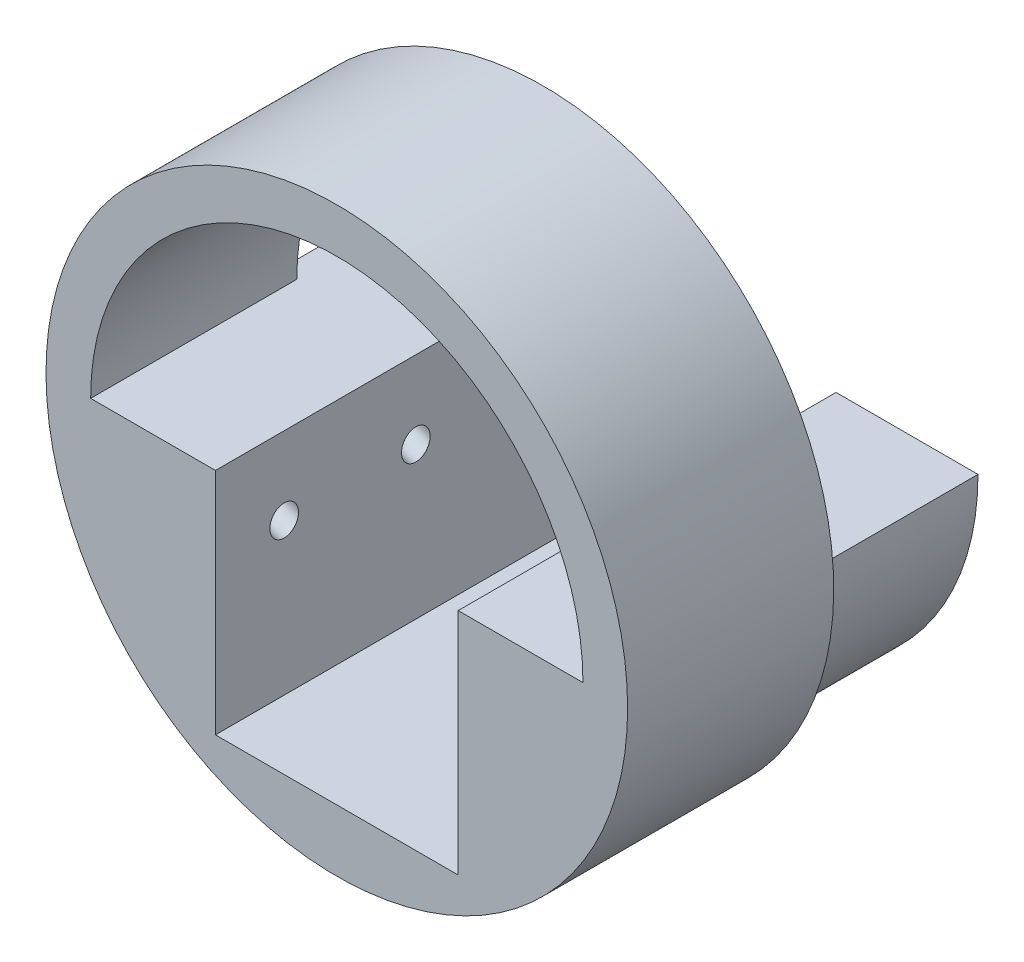
ISO-10303-21;
HEADER;
FILE_DESCRIPTION(('STEP AP214'),'2;1');
FILE_NAME('part.step','',(''),(''),'','','');
FILE_SCHEMA(('AUTOMOTIVE_DESIGN { 1 0 10303 214 1 1 1 1 }'));
ENDSEC;
DATA;
#1=APPLICATION_CONTEXT('core data for automotive mechanical design processes');
#2=APPLICATION_PROTOCOL_DEFINITION('international standard','automotive_design',2000,#1);
#3=PRODUCT_CONTEXT('',#1,'mechanical');
#4=PRODUCT('Part','Part','',(#3));
#5=PRODUCT_RELATED_PRODUCT_CATEGORY('part','',(#4));
#6=PRODUCT_DEFINITION_FORMATION('','',#4);
#7=PRODUCT_DEFINITION_CONTEXT('part definition',#1,'design');
#8=PRODUCT_DEFINITION('design','',#6,#7);
#9=PRODUCT_DEFINITION_SHAPE('','',#8);
#10=(LENGTH_UNIT() NAMED_UNIT(*) SI_UNIT(.MILLI.,.METRE.));
#11=(NAMED_UNIT(*) PLANE_ANGLE_UNIT() SI_UNIT($,.RADIAN.));
#12=(NAMED_UNIT(*) SI_UNIT($,.STERADIAN.) SOLID_ANGLE_UNIT());
#13=UNCERTAINTY_MEASURE_WITH_UNIT(LENGTH_MEASURE(1.E-05),#10,'distance_accuracy_value','');
#14=(GEOMETRIC_REPRESENTATION_CONTEXT(3) GLOBAL_UNCERTAINTY_ASSIGNED_CONTEXT((#13)) GLOBAL_UNIT_ASSIGNED_CONTEXT((#10,
#11,#12)) REPRESENTATION_CONTEXT('',''));
#15=CARTESIAN_POINT('',(0.,0.,0.));
#16=DIRECTION('',(0.,0.,1.));
#17=DIRECTION('',(1.,0.,0.));
#18=AXIS2_PLACEMENT_3D('',#15,#16,#17);
#19=CARTESIAN_POINT('',(0.,0.,0.));
#20=DIRECTION('',(0.,0.,1.));
#21=DIRECTION('',(1.,0.,0.));
#22=AXIS2_PLACEMENT_3D('',#19,#20,#21);
#23=CYLINDRICAL_SURFACE('',#22,21.5);
#24=CARTESIAN_POINT('',(0.,0.,15.));
#25=DIRECTION('',(0.,0.,-1.));
#26=DIRECTION('',(-1.,0.,0.));
#27=AXIS2_PLACEMENT_3D('',#24,#25,#26);
#28=CIRCLE('',#27,21.5);
#29=CARTESIAN_POINT('',(21.5,0.,15.));
#30=VERTEX_POINT('',#29);
#31=CARTESIAN_POINT('',(-21.5,0.,15.));
#32=VERTEX_POINT('',#31);
#33=EDGE_CURVE('E118',#30,#32,#28,.F.);
#34=ORIENTED_EDGE('',*,*,#33,.F.);
#35=DIRECTION('',(0.,0.,1.));
#36=VECTOR('',#35,1.);
#37=CARTESIAN_POINT('',(21.5,0.,0.));
#38=LINE('',#37,#36);
#39=CARTESIAN_POINT('',(21.5,0.,33.));
#40=VERTEX_POINT('',#39);
#41=EDGE_CURVE('E151',#30,#40,#38,.T.);
#42=ORIENTED_EDGE('',*,*,#41,.T.);
#43=CARTESIAN_POINT('',(0.,0.,33.));
#44=DIRECTION('',(0.,0.,1.));
#45=DIRECTION('',(1.,0.,0.));
#46=AXIS2_PLACEMENT_3D('',#43,#44,#45);
#47=CIRCLE('',#46,21.5);
#48=CARTESIAN_POINT('',(-21.5,0.,33.));
#49=VERTEX_POINT('',#48);
#50=EDGE_CURVE('E136',#40,#49,#47,.T.);
#51=ORIENTED_EDGE('',*,*,#50,.T.);
#52=DIRECTION('',(0.,0.,1.));
#53=VECTOR('',#52,1.);
#54=CARTESIAN_POINT('',(-21.5,0.,0.));
#55=LINE('',#54,#53);
#56=EDGE_CURVE('E130',#32,#49,#55,.T.);
#57=ORIENTED_EDGE('',*,*,#56,.F.);
#58=EDGE_LOOP('',(#34,#42,#51,#57));
#59=FACE_BOUND('',#58,.T.);
#60=ADVANCED_FACE('F41',(#59),#23,.F.);
#61=CARTESIAN_POINT('',(0.,0.,33.));
#62=DIRECTION('',(0.,0.,-1.));
#63=DIRECTION('',(-1.,0.,0.));
#64=AXIS2_PLACEMENT_3D('',#61,#62,#63);
#65=CYLINDRICAL_SURFACE('',#64,25.4);
#66=CARTESIAN_POINT('',(-25.2470984850926,-2.78280759019296,27.));
#67=CARTESIAN_POINT('',(-25.2470992023778,-2.7828033142921,26.9349369943768));
#68=CARTESIAN_POINT('',(-25.2477245907166,-2.77714528730477,26.8698188111489));
#69=CARTESIAN_POINT('',(-25.2501755970138,-2.75476909462255,26.7414848548694));
#70=CARTESIAN_POINT('',(-25.2520028646143,-2.73803572724584,26.6782718216295));
#71=CARTESIAN_POINT('',(-25.2567017748821,-2.69434456759552,26.5557435200155));
#72=CARTESIAN_POINT('',(-25.2595704450516,-2.66741586678455,26.4964177195756));
#73=CARTESIAN_POINT('',(-25.2661401121993,-2.60445028150421,26.3829052118677));
#74=CARTESIAN_POINT('',(-25.2698410572259,-2.56841396552598,26.3287181841311));
#75=CARTESIAN_POINT('',(-25.2780144597411,-2.48671268275568,26.2242455124884));
#76=CARTESIAN_POINT('',(-25.2825140765213,-2.44068833712564,26.1742438738129));
#77=CARTESIAN_POINT('',(-25.2918857307816,-2.34157933961969,26.0818655540364));
#78=CARTESIAN_POINT('',(-25.2967579040326,-2.28849210854809,26.0394916717732));
#79=CARTESIAN_POINT('',(-25.3071027588989,-2.1712516492531,25.9592458913499));
#80=CARTESIAN_POINT('',(-25.3125877177234,-2.10652423712848,25.9222141539749));
#81=CARTESIAN_POINT('',(-25.3234148408743,-1.9721084858566,25.8586074957678));
#82=CARTESIAN_POINT('',(-25.3287569441843,-1.90241807203561,25.8320369786799));
#83=CARTESIAN_POINT('',(-25.3394897830852,-1.75391977916117,25.7880045569257));
#84=CARTESIAN_POINT('',(-25.344848451706,-1.67483324354703,25.7714704061136));
#85=CARTESIAN_POINT('',(-25.3549063570621,-1.51497275882659,25.7514530221639));
#86=CARTESIAN_POINT('',(-25.3596054257027,-1.43419838558955,25.7479731100213));
#87=CARTESIAN_POINT('',(-25.3683403335487,-1.2705243975847,25.7543775554942));
#88=CARTESIAN_POINT('',(-25.3723501277205,-1.18763951914522,25.764693271932));
#89=CARTESIAN_POINT('',(-25.3794473989609,-1.02483597468641,25.7994828212928));
#90=CARTESIAN_POINT('',(-25.3825349410196,-0.944917100003764,25.8239556562219));
#91=CARTESIAN_POINT('',(-25.3877352092036,-0.792803551942171,25.8859014455232));
#92=CARTESIAN_POINT('',(-25.389872501333,-0.7204565158814,25.9229967213175));
#93=CARTESIAN_POINT('',(-25.3933868487226,-0.583602450017034,26.0096276728924));
#94=CARTESIAN_POINT('',(-25.3947642102337,-0.519092270157566,26.0591583255083));
#95=CARTESIAN_POINT('',(-25.3968411264572,-0.40440168130521,26.1657779172813));
#96=CARTESIAN_POINT('',(-25.3975795255551,-0.353555239230089,26.2221491540811));
#97=CARTESIAN_POINT('',(-25.3986798667242,-0.262911920894951,26.3431764356503));
#98=CARTESIAN_POINT('',(-25.3990419859301,-0.223109851937651,26.4078285660489));
#99=CARTESIAN_POINT('',(-25.3995239927473,-0.158595788877103,26.5386457527658));
#100=CARTESIAN_POINT('',(-25.3996591099992,-0.133020145091235,26.604385466387));
#101=CARTESIAN_POINT('',(-25.3998341200239,-0.0938886191479115,26.7393482552217));
#102=CARTESIAN_POINT('',(-25.3998740436717,-0.0803288406522046,26.8085701935677));
#103=CARTESIAN_POINT('',(-25.3999148506995,-0.0661243018027638,26.9450101578284));
#104=CARTESIAN_POINT('',(-25.3999174888317,-0.0648998333809021,27.0121684251356));
#105=CARTESIAN_POINT('',(-25.3998928842274,-0.0739024545409846,27.1457070107512));
#106=CARTESIAN_POINT('',(-25.3998656451216,-0.0841281527459091,27.212087422591));
#107=CARTESIAN_POINT('',(-25.3997423358692,-0.115444185880353,27.3413407481168));
#108=CARTESIAN_POINT('',(-25.3996471326358,-0.136396752081029,27.4042471938425));
#109=CARTESIAN_POINT('',(-25.399314924814,-0.188339900254402,27.5257596511105));
#110=CARTESIAN_POINT('',(-25.3990779117555,-0.219331081773828,27.5843654055415));
#111=CARTESIAN_POINT('',(-25.3983575724647,-0.291108559868952,27.6970874530898));
#112=CARTESIAN_POINT('',(-25.3978688311442,-0.332099308743738,27.7510732749127));
#113=CARTESIAN_POINT('',(-25.3965315171046,-0.422150824779794,27.8518140899604));
#114=CARTESIAN_POINT('',(-25.3956828731851,-0.471213187592155,27.89856764991));
#115=CARTESIAN_POINT('',(-25.393467800202,-0.578634604157961,27.9861153348292));
#116=CARTESIAN_POINT('',(-25.3920771141778,-0.637340746997968,28.0264824973185));
#117=CARTESIAN_POINT('',(-25.3886920310633,-0.760330537309656,28.0975151780854));
#118=CARTESIAN_POINT('',(-25.3866974612789,-0.824615776492177,28.1281779160289));
#119=CARTESIAN_POINT('',(-25.3818919115726,-0.961539886204845,28.1811215940134));
#120=CARTESIAN_POINT('',(-25.3790349307647,-1.03444973845587,28.202697491225));
#121=CARTESIAN_POINT('',(-25.3725577495182,-1.1827197224137,28.2341253246166));
#122=CARTESIAN_POINT('',(-25.3689372997548,-1.25808064774726,28.2439734238672));
#123=CARTESIAN_POINT('',(-25.3607274319644,-1.4142102405673,28.2522021491107));
#124=CARTESIAN_POINT('',(-25.3560909830508,-1.49501760423546,28.2498123798495));
#125=CARTESIAN_POINT('',(-25.3461424620279,-1.65514488114434,28.231956418999));
#126=CARTESIAN_POINT('',(-25.3408302045934,-1.73446437949976,28.2164866339183));
#127=CARTESIAN_POINT('',(-25.3295658709198,-1.89196189030294,28.172096382446));
#128=CARTESIAN_POINT('',(-25.3235988223152,-1.97002343147524,28.1427639067084));
#129=CARTESIAN_POINT('',(-25.3114920165989,-2.11991247696271,28.0710358457202));
#130=CARTESIAN_POINT('',(-25.3053522614233,-2.19174005112183,28.0286404068482));
#131=CARTESIAN_POINT('',(-25.293473636138,-2.32476533208917,27.9329091742277));
#132=CARTESIAN_POINT('',(-25.2877283848843,-2.38620104008031,27.8799063006637));
#133=CARTESIAN_POINT('',(-25.2769022539066,-2.49827726961841,27.7633919983072));
#134=CARTESIAN_POINT('',(-25.271821158099,-2.54892130564166,27.6998840026763));
#135=CARTESIAN_POINT('',(-25.2631887625701,-2.63304602543185,27.5700404769582));
#136=CARTESIAN_POINT('',(-25.2595429062986,-2.66763560178894,27.5044299841009));
#137=CARTESIAN_POINT('',(-25.2535393781702,-2.72388721085156,27.3679115467839));
#138=CARTESIAN_POINT('',(-25.2511786678179,-2.74557974757321,27.297016552189));
#139=CARTESIAN_POINT('',(-25.2487581816582,-2.76771734548101,27.1877945061657));
#140=CARTESIAN_POINT('',(-25.2481377400809,-2.77336524977852,27.1504695759207));
#141=CARTESIAN_POINT('',(-25.247307689068,-2.78091156409561,27.0754359414524));
#142=CARTESIAN_POINT('',(-25.2470980691696,-2.78281006960452,27.0377272470273));
#143=CARTESIAN_POINT('',(-25.2470984850926,-2.78280759019296,27.));
#144=B_SPLINE_CURVE_WITH_KNOTS('',3,(#66,#67,#68,#69,#70,#71,#72,#73,#74,#75,#76,#77,#78,#79,
#80,#81,#82,#83,#84,#85,#86,#87,#88,#89,#90,#91,#92,#93,#94,#95,#96,#97,#98,#99,#100,#101,#102,
#103,#104,#105,#106,#107,#108,#109,#110,#111,#112,#113,#114,#115,#116,#117,#118,#119,#120,#121,
#122,#123,#124,#125,#126,#127,#128,#129,#130,#131,#132,#133,#134,#135,#136,#137,#138,#139,#140,
#141,#142,#143),.UNSPECIFIED.,.T.,.F.,(4,2,2,2,2,2,2,2,2,2,2,2,2,2,2,2,2,2,2,2,2,2,2,2,2,2,2,2,
2,2,2,2,2,2,2,2,2,2,4),(0.,0.195041465897669,0.390351196603801,0.585107778242168,
0.779852206308412,0.983331582969405,1.18688547040494,1.41026034686522,1.63372915469336,
1.87555869395402,2.11744975041689,2.36708379104587,2.61670023608194,2.85942321715989,
3.10204830966095,3.32860683156847,3.5550586519985,3.76560228873901,3.9760776282979,
4.17661259401462,4.37712319419367,4.57512086670622,4.77313036662198,4.97558922340573,
5.1780881518211,5.39094141262048,5.60385560114784,5.8311340892481,6.05848691458632,
6.30032134062495,6.54222222777545,6.79181403697243,7.04140304943896,7.28412838522298,
7.52677455249645,7.74833937308642,7.9693780430766,8.08247710610974,8.19557328870986),.UNSPECIFIED.);
#145=CARTESIAN_POINT('',(-25.2470984850926,-2.78280759019296,27.));
#146=VERTEX_POINT('',#145);
#147=EDGE_CURVE('E125',#146,#146,#144,.T.);
#148=ORIENTED_EDGE('',*,*,#147,.T.);
#149=EDGE_LOOP('',(#148));
#150=FACE_BOUND('',#149,.T.);
#151=CARTESIAN_POINT('',(0.,0.,33.));
#152=DIRECTION('',(0.,0.,1.));
#153=DIRECTION('',(1.,0.,0.));
#154=AXIS2_PLACEMENT_3D('',#151,#152,#153);
#155=CIRCLE('',#154,25.4);
#156=CARTESIAN_POINT('',(25.4,0.,33.));
#157=VERTEX_POINT('',#156);
#158=EDGE_CURVE('E147',#157,#157,#155,.T.);
#159=ORIENTED_EDGE('',*,*,#158,.F.);
#160=EDGE_LOOP('',(#159));
#161=FACE_BOUND('',#160,.T.);
#162=CARTESIAN_POINT('',(0.,0.,15.));
#163=DIRECTION('',(0.,0.,-1.));
#164=DIRECTION('',(-1.,0.,0.));
#165=AXIS2_PLACEMENT_3D('',#162,#163,#164);
#166=CIRCLE('',#165,25.4);
#167=CARTESIAN_POINT('',(-25.3993763478534,-0.177991966400375,15.));
#168=VERTEX_POINT('',#167);
#169=CARTESIAN_POINT('',(-25.2595718119854,-2.66721425370189,15.));
#170=VERTEX_POINT('',#169);
#171=EDGE_CURVE('E200',#168,#170,#166,.T.);
#172=ORIENTED_EDGE('',*,*,#171,.F.);
#173=CARTESIAN_POINT('',(-25.3993763478534,-0.177991966400375,15.));
#174=CARTESIAN_POINT('',(-25.399474527587,-0.163950795696631,15.0301542366214));
#175=CARTESIAN_POINT('',(-25.3995527516795,-0.151163228135119,15.0608768446247));
#176=CARTESIAN_POINT('',(-25.3996791547985,-0.128189086484978,15.1232817737091));
#177=CARTESIAN_POINT('',(-25.3997273317029,-0.118002696132125,15.1549641624083));
#178=CARTESIAN_POINT('',(-25.3998414644392,-0.0915149545401005,15.2510836553571));
#179=CARTESIAN_POINT('',(-25.3998772551913,-0.0792427850426561,15.3166837014174));
#180=CARTESIAN_POINT('',(-25.3999152208423,-0.0659618707958324,15.4490530880837));
#181=CARTESIAN_POINT('',(-25.399917361033,-0.0649647557434958,15.5158235648742));
#182=CARTESIAN_POINT('',(-25.3998917902021,-0.0742845969370775,15.6485501521892));
#183=CARTESIAN_POINT('',(-25.3998640908893,-0.0845971153804284,15.7145065718763));
#184=CARTESIAN_POINT('',(-25.3997396892024,-0.116041478941625,15.8433103439457));
#185=CARTESIAN_POINT('',(-25.3996434477853,-0.137100783375528,15.9061754825843));
#186=CARTESIAN_POINT('',(-25.3993082511011,-0.189252234706664,16.027603606843));
#187=CARTESIAN_POINT('',(-25.399069254699,-0.220347272219535,16.0861653469715));
#188=CARTESIAN_POINT('',(-25.3983437090126,-0.292328652748819,16.1987882697297));
#189=CARTESIAN_POINT('',(-25.3978516950218,-0.333420116653921,16.2527180677635));
#190=CARTESIAN_POINT('',(-25.3965065808918,-0.423658044623385,16.3533275713893));
#191=CARTESIAN_POINT('',(-25.3956534419278,-0.472805374429942,16.4000064966982));
#192=CARTESIAN_POINT('',(-25.3934278211322,-0.580394998857583,16.4873969158816));
#193=CARTESIAN_POINT('',(-25.3920309480672,-0.639184726936914,16.5276795819858));
#194=CARTESIAN_POINT('',(-25.3886322927205,-0.762329035741541,16.5985329886841));
#195=CARTESIAN_POINT('',(-25.3866303178061,-0.826685383921797,16.6291006301589));
#196=CARTESIAN_POINT('',(-25.381808561105,-0.963742725447675,16.6818385166102));
#197=CARTESIAN_POINT('',(-25.3789427009802,-1.0367137600643,16.7033027121753));
#198=CARTESIAN_POINT('',(-25.3724474511787,-1.18508677705053,16.734497619612));
#199=CARTESIAN_POINT('',(-25.368817823537,-1.2604895108432,16.7442246681993));
#200=CARTESIAN_POINT('',(-25.360589737922,-1.41667891982625,16.7521959058631));
#201=CARTESIAN_POINT('',(-25.3559443396916,-1.49750297658025,16.7496703305244));
#202=CARTESIAN_POINT('',(-25.3459792849003,-1.65764215000621,16.731538484299));
#203=CARTESIAN_POINT('',(-25.340659433124,-1.73695682212348,16.7159284188379));
#204=CARTESIAN_POINT('',(-25.3293835328717,-1.89439990351796,16.6712556883479));
#205=CARTESIAN_POINT('',(-25.3234127101901,-1.97241198574659,16.6417842319311));
#206=CARTESIAN_POINT('',(-25.3113021661208,-2.12217583167331,16.5697842927391));
#207=CARTESIAN_POINT('',(-25.3051624478917,-2.19392771234314,16.5272560539968));
#208=CARTESIAN_POINT('',(-25.2932900705956,-2.32675872559589,16.4312839937364));
#209=CARTESIAN_POINT('',(-25.2875508428286,-2.38807885179825,16.3781759844223));
#210=CARTESIAN_POINT('',(-25.2767422446816,-2.4998925636224,16.2614842966682));
#211=CARTESIAN_POINT('',(-25.2716725407846,-2.55039154756004,16.197905869707));
#212=CARTESIAN_POINT('',(-25.2630687086823,-2.63419521551991,16.0679924168657));
#213=CARTESIAN_POINT('',(-25.2594389690911,-2.66861858567719,16.0023867255835));
#214=CARTESIAN_POINT('',(-25.2534638987403,-2.72458490178619,15.8658670593333));
#215=CARTESIAN_POINT('',(-25.2511171129826,-2.74614244143511,15.7949592017794));
#216=CARTESIAN_POINT('',(-25.2481031761648,-2.77370832371187,15.6575677994132));
#217=CARTESIAN_POINT('',(-25.2472910563396,-2.7810604040101,15.5913547302131));
#218=CARTESIAN_POINT('',(-25.2469669797181,-2.7840007266374,15.4586302930466));
#219=CARTESIAN_POINT('',(-25.2474552738866,-2.7795866982446,15.3921188699742));
#220=CARTESIAN_POINT('',(-25.2495370795835,-2.76060859233885,15.2699309897574));
#221=CARTESIAN_POINT('',(-25.2509704192961,-2.74751418006156,15.2140160703116));
#222=CARTESIAN_POINT('',(-25.2546714039726,-2.7132681898047,15.1047844347023));
#223=CARTESIAN_POINT('',(-25.2569383798453,-2.69212307298374,15.0514656735737));
#224=CARTESIAN_POINT('',(-25.2595718119854,-2.66721425370189,15.));
#225=B_SPLINE_CURVE_WITH_KNOTS('',3,(#173,#174,#175,#176,#177,#178,#179,#180,#181,#182,#183,
#184,#185,#186,#187,#188,#189,#190,#191,#192,#193,#194,#195,#196,#197,#198,#199,#200,#201,#202,
#203,#204,#205,#206,#207,#208,#209,#210,#211,#212,#213,#214,#215,#216,#217,#218,#219,#220,#221,
#222,#223,#224),.UNSPECIFIED.,.F.,.F.,(4,2,2,2,2,2,2,2,2,2,2,2,2,2,2,2,2,2,2,2,2,2,2,2,2,4),(0.,
0.0997322608501952,0.199471564403484,0.398654003012475,0.598041870374513,0.7973515276426,
0.995333299625444,1.19337214772878,1.39588005000888,1.59840972955323,1.81132643401711,
2.02431099147844,2.2516711788974,2.47910230943051,2.72100000923164,2.96296788498299,
3.21256790975645,3.46216326975913,3.70482943738347,3.94737426345757,4.16867266995846,
4.38971957847074,4.58857531312692,4.78746942740081,4.95918051215725,5.13075407828144),.UNSPECIFIED.);
#226=EDGE_CURVE('E183',#168,#170,#225,.T.);
#227=ORIENTED_EDGE('',*,*,#226,.T.);
#228=EDGE_LOOP('',(#172,#227));
#229=FACE_BOUND('',#228,.T.);
#230=ADVANCED_FACE('F43',(#150,#161,#229),#65,.T.);
#231=CARTESIAN_POINT('',(0.,0.,0.));
#232=DIRECTION('',(0.,0.,1.));
#233=DIRECTION('',(1.,0.,0.));
#234=AXIS2_PLACEMENT_3D('',#231,#232,#233);
#235=PLANE('',#234);
#236=CARTESIAN_POINT('',(0.,0.,0.));
#237=DIRECTION('',(0.,0.,-1.));
#238=DIRECTION('',(-1.,0.,0.));
#239=AXIS2_PLACEMENT_3D('',#236,#237,#238);
#240=CIRCLE('',#239,23.);
#241=CARTESIAN_POINT('',(23.,0.,0.));
#242=VERTEX_POINT('',#241);
#243=CARTESIAN_POINT('',(-23.,0.,0.));
#244=VERTEX_POINT('',#243);
#245=EDGE_CURVE('E197',#242,#244,#240,.T.);
#246=ORIENTED_EDGE('',*,*,#245,.T.);
#247=DIRECTION('',(1.,0.,0.));
#248=VECTOR('',#247,1.);
#249=CARTESIAN_POINT('',(-21.5,0.,0.));
#250=LINE('',#249,#248);
#251=CARTESIAN_POINT('',(-10.6,0.,0.));
#252=VERTEX_POINT('',#251);
#253=EDGE_CURVE('E205',#244,#252,#250,.T.);
#254=ORIENTED_EDGE('',*,*,#253,.T.);
#255=DIRECTION('',(0.,-1.,0.));
#256=VECTOR('',#255,1.);
#257=CARTESIAN_POINT('',(-10.6,0.,0.));
#258=LINE('',#257,#256);
#259=CARTESIAN_POINT('',(-10.6,-20.,0.));
#260=VERTEX_POINT('',#259);
#261=EDGE_CURVE('E208',#252,#260,#258,.T.);
#262=ORIENTED_EDGE('',*,*,#261,.T.);
#263=DIRECTION('',(1.,0.,0.));
#264=VECTOR('',#263,1.);
#265=CARTESIAN_POINT('',(-10.6,-20.,0.));
#266=LINE('',#265,#264);
#267=CARTESIAN_POINT('',(10.6,-20.,0.));
#268=VERTEX_POINT('',#267);
#269=EDGE_CURVE('E212',#260,#268,#266,.T.);
#270=ORIENTED_EDGE('',*,*,#269,.T.);
#271=DIRECTION('',(0.,1.,0.));
#272=VECTOR('',#271,1.);
#273=CARTESIAN_POINT('',(10.6,-20.,0.));
#274=LINE('',#273,#272);
#275=CARTESIAN_POINT('',(10.6,0.,0.));
#276=VERTEX_POINT('',#275);
#277=EDGE_CURVE('E143',#268,#276,#274,.T.);
#278=ORIENTED_EDGE('',*,*,#277,.T.);
#279=DIRECTION('',(1.,0.,0.));
#280=VECTOR('',#279,1.);
#281=CARTESIAN_POINT('',(10.6,0.,0.));
#282=LINE('',#281,#280);
#283=EDGE_CURVE('E139',#276,#242,#282,.T.);
#284=ORIENTED_EDGE('',*,*,#283,.T.);
#285=EDGE_LOOP('',(#246,#254,#262,#270,#278,#284));
#286=FACE_BOUND('',#285,.T.);
#287=ADVANCED_FACE('F253',(#286),#235,.F.);
#288=CARTESIAN_POINT('',(0.,0.,33.));
#289=DIRECTION('',(0.,0.,1.));
#290=DIRECTION('',(1.,0.,0.));
#291=AXIS2_PLACEMENT_3D('',#288,#289,#290);
#292=PLANE('',#291);
#293=ORIENTED_EDGE('',*,*,#50,.F.);
#294=DIRECTION('',(1.,0.,0.));
#295=VECTOR('',#294,1.);
#296=CARTESIAN_POINT('',(10.6,0.,33.));
#297=LINE('',#296,#295);
#298=CARTESIAN_POINT('',(10.6,0.,33.));
#299=VERTEX_POINT('',#298);
#300=EDGE_CURVE('E209',#299,#40,#297,.T.);
#301=ORIENTED_EDGE('',*,*,#300,.F.);
#302=DIRECTION('',(0.,1.,0.));
#303=VECTOR('',#302,1.);
#304=CARTESIAN_POINT('',(10.6,-20.,33.));
#305=LINE('',#304,#303);
#306=CARTESIAN_POINT('',(10.6,-20.,33.));
#307=VERTEX_POINT('',#306);
#308=EDGE_CURVE('E226',#307,#299,#305,.T.);
#309=ORIENTED_EDGE('',*,*,#308,.F.);
#310=DIRECTION('',(1.,0.,0.));
#311=VECTOR('',#310,1.);
#312=CARTESIAN_POINT('',(-10.6,-20.,33.));
#313=LINE('',#312,#311);
#314=CARTESIAN_POINT('',(-10.6,-20.,33.));
#315=VERTEX_POINT('',#314);
#316=EDGE_CURVE('E223',#315,#307,#313,.T.);
#317=ORIENTED_EDGE('',*,*,#316,.F.);
#318=DIRECTION('',(0.,-1.,0.));
#319=VECTOR('',#318,1.);
#320=CARTESIAN_POINT('',(-10.6,0.,33.));
#321=LINE('',#320,#319);
#322=CARTESIAN_POINT('',(-10.6,0.,33.));
#323=VERTEX_POINT('',#322);
#324=EDGE_CURVE('E220',#323,#315,#321,.T.);
#325=ORIENTED_EDGE('',*,*,#324,.F.);
#326=DIRECTION('',(1.,0.,0.));
#327=VECTOR('',#326,1.);
#328=CARTESIAN_POINT('',(-21.5,0.,33.));
#329=LINE('',#328,#327);
#330=EDGE_CURVE('E218',#49,#323,#329,.T.);
#331=ORIENTED_EDGE('',*,*,#330,.F.);
#332=EDGE_LOOP('',(#293,#301,#309,#317,#325,#331));
#333=FACE_BOUND('',#332,.T.);
#334=ORIENTED_EDGE('',*,*,#158,.T.);
#335=EDGE_LOOP('',(#334));
#336=FACE_BOUND('',#335,.T.);
#337=ADVANCED_FACE('F245',(#333,#336),#292,.T.);
#338=CARTESIAN_POINT('',(10.6,0.,0.));
#339=DIRECTION('',(0.,-1.,0.));
#340=DIRECTION('',(0.,0.,-1.));
#341=AXIS2_PLACEMENT_3D('',#338,#339,#340);
#342=PLANE('',#341);
#343=DIRECTION('',(0.,0.,1.));
#344=VECTOR('',#343,1.);
#345=CARTESIAN_POINT('',(10.6,0.,0.));
#346=LINE('',#345,#344);
#347=EDGE_CURVE('E232',#276,#299,#346,.T.);
#348=ORIENTED_EDGE('',*,*,#347,.T.);
#349=ORIENTED_EDGE('',*,*,#300,.T.);
#350=ORIENTED_EDGE('',*,*,#41,.F.);
#351=DIRECTION('',(1.,0.,0.));
#352=VECTOR('',#351,1.);
#353=CARTESIAN_POINT('',(26.2775966813869,0.,15.));
#354=LINE('',#353,#352);
#355=CARTESIAN_POINT('',(23.,0.,15.));
#356=VERTEX_POINT('',#355);
#357=EDGE_CURVE('E121',#30,#356,#354,.T.);
#358=ORIENTED_EDGE('',*,*,#357,.T.);
#359=DIRECTION('',(0.,0.,-1.));
#360=VECTOR('',#359,1.);
#361=CARTESIAN_POINT('',(23.,0.,15.));
#362=LINE('',#361,#360);
#363=EDGE_CURVE('E50',#356,#242,#362,.T.);
#364=ORIENTED_EDGE('',*,*,#363,.T.);
#365=ORIENTED_EDGE('',*,*,#283,.F.);
#366=EDGE_LOOP('',(#348,#349,#350,#358,#364,#365));
#367=FACE_BOUND('',#366,.T.);
#368=ADVANCED_FACE('F260',(#367),#342,.F.);
#369=CARTESIAN_POINT('',(10.6,-20.,0.));
#370=DIRECTION('',(1.,0.,0.));
#371=DIRECTION('',(0.,1.,0.));
#372=AXIS2_PLACEMENT_3D('',#369,#370,#371);
#373=PLANE('',#372);
#374=ORIENTED_EDGE('',*,*,#308,.T.);
#375=ORIENTED_EDGE('',*,*,#347,.F.);
#376=ORIENTED_EDGE('',*,*,#277,.F.);
#377=DIRECTION('',(0.,0.,1.));
#378=VECTOR('',#377,1.);
#379=CARTESIAN_POINT('',(10.6,-20.,0.));
#380=LINE('',#379,#378);
#381=EDGE_CURVE('E234',#268,#307,#380,.T.);
#382=ORIENTED_EDGE('',*,*,#381,.T.);
#383=EDGE_LOOP('',(#374,#375,#376,#382));
#384=FACE_BOUND('',#383,.T.);
#385=ADVANCED_FACE('F249',(#384),#373,.F.);
#386=CARTESIAN_POINT('',(-10.6,-20.,0.));
#387=DIRECTION('',(0.,-1.,0.));
#388=DIRECTION('',(0.,0.,-1.));
#389=AXIS2_PLACEMENT_3D('',#386,#387,#388);
#390=PLANE('',#389);
#391=ORIENTED_EDGE('',*,*,#316,.T.);
#392=ORIENTED_EDGE('',*,*,#381,.F.);
#393=ORIENTED_EDGE('',*,*,#269,.F.);
#394=DIRECTION('',(0.,0.,1.));
#395=VECTOR('',#394,1.);
#396=CARTESIAN_POINT('',(-10.6,-20.,0.));
#397=LINE('',#396,#395);
#398=EDGE_CURVE('E141',#260,#315,#397,.T.);
#399=ORIENTED_EDGE('',*,*,#398,.T.);
#400=EDGE_LOOP('',(#391,#392,#393,#399));
#401=FACE_BOUND('',#400,.T.);
#402=ADVANCED_FACE('F237',(#401),#390,.F.);
#403=CARTESIAN_POINT('',(-10.6,0.,0.));
#404=DIRECTION('',(-1.,0.,0.));
#405=DIRECTION('',(0.,0.,1.));
#406=AXIS2_PLACEMENT_3D('',#403,#404,#405);
#407=PLANE('',#406);
#408=CARTESIAN_POINT('',(-10.6,-6.78369324153738,27.));
#409=DIRECTION('',(-1.,0.,0.));
#410=DIRECTION('',(0.,1.,0.));
#411=AXIS2_PLACEMENT_3D('',#408,#409,#410);
#412=ELLIPSE('',#411,1.33022221559488,1.24999999999999);
#413=CARTESIAN_POINT('',(-10.6,-5.4534710259425,27.));
#414=VERTEX_POINT('',#413);
#415=EDGE_CURVE('E265',#414,#414,#412,.T.);
#416=ORIENTED_EDGE('',*,*,#415,.T.);
#417=EDGE_LOOP('',(#416));
#418=FACE_BOUND('',#417,.T.);
#419=CARTESIAN_POINT('',(-10.6,-6.78369324153738,15.5));
#420=DIRECTION('',(-1.,0.,0.));
#421=DIRECTION('',(0.,1.,0.));
#422=AXIS2_PLACEMENT_3D('',#419,#420,#421);
#423=ELLIPSE('',#422,1.33022221559488,1.24999999999999);
#424=CARTESIAN_POINT('',(-10.6,-5.4534710259425,15.5));
#425=VERTEX_POINT('',#424);
#426=EDGE_CURVE('E161',#425,#425,#423,.T.);
#427=ORIENTED_EDGE('',*,*,#426,.T.);
#428=EDGE_LOOP('',(#427));
#429=FACE_BOUND('',#428,.T.);
#430=CARTESIAN_POINT('',(-10.6,-6.78369324153737,6.));
#431=DIRECTION('',(-1.,0.,0.));
#432=DIRECTION('',(0.,1.,0.));
#433=AXIS2_PLACEMENT_3D('',#430,#431,#432);
#434=ELLIPSE('',#433,1.33022221559488,1.24999999999999);
#435=CARTESIAN_POINT('',(-10.6,-5.45347102594249,6.));
#436=VERTEX_POINT('',#435);
#437=EDGE_CURVE('E160',#436,#436,#434,.T.);
#438=ORIENTED_EDGE('',*,*,#437,.T.);
#439=EDGE_LOOP('',(#438));
#440=FACE_BOUND('',#439,.T.);
#441=ORIENTED_EDGE('',*,*,#324,.T.);
#442=ORIENTED_EDGE('',*,*,#398,.F.);
#443=ORIENTED_EDGE('',*,*,#261,.F.);
#444=DIRECTION('',(0.,0.,1.));
#445=VECTOR('',#444,1.);
#446=CARTESIAN_POINT('',(-10.6,0.,0.));
#447=LINE('',#446,#445);
#448=EDGE_CURVE('E138',#252,#323,#447,.T.);
#449=ORIENTED_EDGE('',*,*,#448,.T.);
#450=EDGE_LOOP('',(#441,#442,#443,#449));
#451=FACE_BOUND('',#450,.T.);
#452=ADVANCED_FACE('F242',(#418,#429,#440,#451),#407,.F.);
#453=CARTESIAN_POINT('',(-21.5,0.,0.));
#454=DIRECTION('',(0.,-1.,0.));
#455=DIRECTION('',(0.,0.,-1.));
#456=AXIS2_PLACEMENT_3D('',#453,#454,#455);
#457=PLANE('',#456);
#458=ORIENTED_EDGE('',*,*,#253,.F.);
#459=DIRECTION('',(0.,0.,-1.));
#460=VECTOR('',#459,1.);
#461=CARTESIAN_POINT('',(-23.,0.,15.));
#462=LINE('',#461,#460);
#463=CARTESIAN_POINT('',(-23.,0.,15.));
#464=VERTEX_POINT('',#463);
#465=EDGE_CURVE('E11',#244,#464,#462,.F.);
#466=ORIENTED_EDGE('',*,*,#465,.T.);
#467=EDGE_CURVE('E57',#464,#32,#354,.T.);
#468=ORIENTED_EDGE('',*,*,#467,.T.);
#469=ORIENTED_EDGE('',*,*,#56,.T.);
#470=ORIENTED_EDGE('',*,*,#330,.T.);
#471=ORIENTED_EDGE('',*,*,#448,.F.);
#472=EDGE_LOOP('',(#458,#466,#468,#469,#470,#471));
#473=FACE_BOUND('',#472,.T.);
#474=ADVANCED_FACE('F128',(#473),#457,.F.);
#475=CARTESIAN_POINT('',(0.,0.,15.));
#476=DIRECTION('',(0.,0.,-1.));
#477=DIRECTION('',(-1.,0.,0.));
#478=AXIS2_PLACEMENT_3D('',#475,#476,#477);
#479=PLANE('',#478);
#480=ORIENTED_EDGE('',*,*,#171,.T.);
#481=DIRECTION('',(-0.939692620785908,0.342020143325669,0.));
#482=VECTOR('',#481,1.);
#483=CARTESIAN_POINT('',(-27.6802273002161,-1.78616770857279,15.));
#484=LINE('',#483,#482);
#485=CARTESIAN_POINT('',(-22.7177213246554,-3.59237217104508,15.));
#486=VERTEX_POINT('',#485);
#487=EDGE_CURVE('E191',#486,#170,#484,.T.);
#488=ORIENTED_EDGE('',*,*,#487,.F.);
#489=CARTESIAN_POINT('',(0.,0.,15.));
#490=DIRECTION('',(0.,0.,-1.));
#491=DIRECTION('',(-1.,0.,0.));
#492=AXIS2_PLACEMENT_3D('',#489,#490,#491);
#493=CIRCLE('',#492,23.);
#494=EDGE_CURVE('E201',#356,#486,#493,.T.);
#495=ORIENTED_EDGE('',*,*,#494,.F.);
#496=ORIENTED_EDGE('',*,*,#357,.F.);
#497=ORIENTED_EDGE('',*,*,#33,.T.);
#498=ORIENTED_EDGE('',*,*,#467,.F.);
#499=CARTESIAN_POINT('',(-22.9755520767697,-1.06019185416682,15.));
#500=VERTEX_POINT('',#499);
#501=EDGE_CURVE('E198',#500,#464,#493,.T.);
#502=ORIENTED_EDGE('',*,*,#501,.F.);
#503=DIRECTION('',(-0.939692620785908,0.342020143325669,0.));
#504=VECTOR('',#503,1.);
#505=CARTESIAN_POINT('',(-26.8965607022214,0.366938573798621,15.));
#506=LINE('',#505,#504);
#507=EDGE_CURVE('E64',#168,#500,#506,.F.);
#508=ORIENTED_EDGE('',*,*,#507,.F.);
#509=EDGE_LOOP('',(#480,#488,#495,#496,#497,#498,#502,#508));
#510=FACE_BOUND('',#509,.T.);
#511=ADVANCED_FACE('F119',(#510),#479,.T.);
#512=CARTESIAN_POINT('',(0.,0.,15.));
#513=DIRECTION('',(0.,0.,-1.));
#514=DIRECTION('',(-1.,0.,0.));
#515=AXIS2_PLACEMENT_3D('',#512,#513,#514);
#516=CYLINDRICAL_SURFACE('',#515,23.);
#517=ORIENTED_EDGE('',*,*,#465,.F.);
#518=ORIENTED_EDGE('',*,*,#245,.F.);
#519=ORIENTED_EDGE('',*,*,#363,.F.);
#520=ORIENTED_EDGE('',*,*,#494,.T.);
#521=CARTESIAN_POINT('',(-22.9755520767697,-1.06019185416682,15.));
#522=CARTESIAN_POINT('',(-22.9748500278814,-1.07540008544925,14.9678028752597));
#523=CARTESIAN_POINT('',(-22.9740675365633,-1.09203539245233,14.93630513081));
#524=CARTESIAN_POINT('',(-22.9723305132371,-1.12798853740448,14.8749022184396));
#525=CARTESIAN_POINT('',(-22.9713760557614,-1.14730521238085,14.8449963678151));
#526=CARTESIAN_POINT('',(-22.9682466126628,-1.20885285342484,14.7581826221736));
#527=CARTESIAN_POINT('',(-22.965799317788,-1.25482410008144,14.7038798790837));
#528=CARTESIAN_POINT('',(-22.9601099756551,-1.35493749579071,14.6037099993843));
#529=CARTESIAN_POINT('',(-22.9568689777535,-1.40906882034995,14.5578318635918));
#530=CARTESIAN_POINT('',(-22.9495342219713,-1.52387258719174,14.4751696336694));
#531=CARTESIAN_POINT('',(-22.9454397734494,-1.58455030773699,14.438392957797));
#532=CARTESIAN_POINT('',(-22.9361060395518,-1.71450524010447,14.3725464635607));
#533=CARTESIAN_POINT('',(-22.9308126992981,-1.7840801914118,14.3440733970296));
#534=CARTESIAN_POINT('',(-22.91926991259,-1.92670469674359,14.2982040743008));
#535=CARTESIAN_POINT('',(-22.9130201883598,-1.99975525597612,14.280811043835));
#536=CARTESIAN_POINT('',(-22.8990733754063,-2.15381203074639,14.2561375158876));
#537=CARTESIAN_POINT('',(-22.8912985825298,-2.23496860252142,14.2498366015325));
#538=CARTESIAN_POINT('',(-22.8748819440527,-2.39717129319849,14.2501699950525));
#539=CARTESIAN_POINT('',(-22.8662398246168,-2.47821736897651,14.2568084004385));
#540=CARTESIAN_POINT('',(-22.8478204397238,-2.64278983251203,14.283529351076));
#541=CARTESIAN_POINT('',(-22.838006491172,-2.72619159035332,14.3043616668085));
#542=CARTESIAN_POINT('',(-22.8180727463934,-2.88829223837165,14.3598762887985));
#543=CARTESIAN_POINT('',(-22.807952766459,-2.96698821581275,14.3945670730666));
#544=CARTESIAN_POINT('',(-22.787975008082,-3.11670889051382,14.4770799287221));
#545=CARTESIAN_POINT('',(-22.7781161605185,-3.18777045365253,14.5248345418619));
#546=CARTESIAN_POINT('',(-22.7592514187329,-3.31977547739323,14.6327186343312));
#547=CARTESIAN_POINT('',(-22.7502433796425,-3.38074468972618,14.6928157132423));
#548=CARTESIAN_POINT('',(-22.7373846193071,-3.46587899379206,14.7953812001817));
#549=CARTESIAN_POINT('',(-22.732996035983,-3.49451076633336,14.8341329625418));
#550=CARTESIAN_POINT('',(-22.7248504504217,-3.54709365696166,14.9147926990945));
#551=CARTESIAN_POINT('',(-22.7210939634068,-3.57104095929086,14.9567032080859));
#552=CARTESIAN_POINT('',(-22.7177213246554,-3.59237217104508,15.));
#553=B_SPLINE_CURVE_WITH_KNOTS('',3,(#521,#522,#523,#524,#525,#526,#527,#528,#529,#530,#531,
#532,#533,#534,#535,#536,#537,#538,#539,#540,#541,#542,#543,#544,#545,#546,#547,#548,#549,#550,
#551,#552),.UNSPECIFIED.,.F.,.F.,(4,2,2,2,2,2,2,2,2,2,2,2,2,2,2,4),(0.,0.106770258673104,
0.213494352419427,0.425962872633333,0.638151990025336,0.850513489362814,1.07565072998637,
1.30085348491363,1.5451011155172,1.78942610489398,2.04777436237312,2.30628090874296,
2.56347700141586,2.82000636178668,2.96484745274493,3.10980603787377),.UNSPECIFIED.);
#554=EDGE_CURVE('E150',#500,#486,#553,.T.);
#555=ORIENTED_EDGE('',*,*,#554,.F.);
#556=ORIENTED_EDGE('',*,*,#501,.T.);
#557=EDGE_LOOP('',(#517,#518,#519,#520,#555,#556));
#558=FACE_BOUND('',#557,.T.);
#559=CARTESIAN_POINT('',(-22.6987545761309,-3.71032891972857,6.));
#560=CARTESIAN_POINT('',(-22.6987555881491,-3.71032438008208,6.06387579760674));
#561=CARTESIAN_POINT('',(-22.699667705847,-3.704755954745,6.12780996079067));
#562=CARTESIAN_POINT('',(-22.7032462811923,-3.68276065139511,6.25378136819785));
#563=CARTESIAN_POINT('',(-22.7059153199586,-3.66631779743077,6.31581568078348));
#564=CARTESIAN_POINT('',(-22.712791279905,-3.62347580946166,6.43599507909647));
#565=CARTESIAN_POINT('',(-22.7169929362253,-3.59711075056944,6.49415268267728));
#566=CARTESIAN_POINT('',(-22.7266491331166,-3.53558828092612,6.60545703516668));
#567=CARTESIAN_POINT('',(-22.7321036292353,-3.50043118212253,6.65860396176537));
#568=CARTESIAN_POINT('',(-22.7442704330343,-3.4205085050387,6.76165985501586));
#569=CARTESIAN_POINT('',(-22.7510348172146,-3.37532606556079,6.81123818904035));
#570=CARTESIAN_POINT('',(-22.7652430194261,-3.27812806736983,6.90303840623716));
#571=CARTESIAN_POINT('',(-22.772687114524,-3.22610971834489,6.94525726892702));
#572=CARTESIAN_POINT('',(-22.7888491094796,-3.11001367410556,7.02648673050306));
#573=CARTESIAN_POINT('',(-22.7976121766848,-3.04523837272039,7.06449166414519));
#574=CARTESIAN_POINT('',(-22.8151845559043,-2.91066409772357,7.13020223952919));
#575=CARTESIAN_POINT('',(-22.8239938889644,-2.84086261337576,7.15790269065762));
#576=CARTESIAN_POINT('',(-22.8422343832169,-2.69047074909701,7.20500636338634));
#577=CARTESIAN_POINT('',(-22.8516353131381,-2.60951212918507,7.2232514898199));
#578=CARTESIAN_POINT('',(-22.8697556907867,-2.44562433484976,7.24647014473909));
#579=CARTESIAN_POINT('',(-22.8784749118016,-2.36269451673087,7.25143927616558));
#580=CARTESIAN_POINT('',(-22.8953338091885,-2.19344938224727,7.24776730002064));
#581=CARTESIAN_POINT('',(-22.9034325329611,-2.10714157428045,7.23853271139664));
#582=CARTESIAN_POINT('',(-22.9184224000552,-1.93731271495642,7.20519134412416));
#583=CARTESIAN_POINT('',(-22.9253136203441,-1.85379148625504,7.18108551382531));
#584=CARTESIAN_POINT('',(-22.9375957336775,-1.69494799485133,7.11915399221334));
#585=CARTESIAN_POINT('',(-22.9430276379174,-1.61944873671621,7.08179284726363));
#586=CARTESIAN_POINT('',(-22.952670104886,-1.47650486497332,6.99381593916543));
#587=CARTESIAN_POINT('',(-22.956881311415,-1.40905601663257,6.94320718975306));
#588=CARTESIAN_POINT('',(-22.963855326888,-1.29019758931191,6.83456756487927));
#589=CARTESIAN_POINT('',(-22.9667086301742,-1.23792604123088,6.77748646660061));
#590=CARTESIAN_POINT('',(-22.9715389902355,-1.14480465575235,6.65462571788336));
#591=CARTESIAN_POINT('',(-22.9735165923774,-1.10394771546274,6.58885151455403));
#592=CARTESIAN_POINT('',(-22.976560893247,-1.03857112805146,6.45677511240946));
#593=CARTESIAN_POINT('',(-22.9776924102261,-1.01293062914886,6.39102815871937));
#594=CARTESIAN_POINT('',(-22.9793834197737,-0.973820782761694,6.25600404071973));
#595=CARTESIAN_POINT('',(-22.9799431483991,-0.960346412880951,6.18672834562638));
#596=CARTESIAN_POINT('',(-22.98051415385,-0.946579115768098,6.05100793752691));
#597=CARTESIAN_POINT('',(-22.980555746421,-0.945557658286808,5.9846363014503));
#598=CARTESIAN_POINT('',(-22.9801713446868,-0.954854210776067,5.85270048324102));
#599=CARTESIAN_POINT('',(-22.9797454190562,-0.965170555320102,5.78713618394781));
#600=CARTESIAN_POINT('',(-22.9784084336939,-0.996485540169032,5.65968976401759));
#601=CARTESIAN_POINT('',(-22.9775048636499,-1.01731904541649,5.59776676384792));
#602=CARTESIAN_POINT('',(-22.9751676472558,-1.06879914706854,5.47816558660513));
#603=CARTESIAN_POINT('',(-22.9737339610958,-1.09944648043495,5.42048772871785));
#604=CARTESIAN_POINT('',(-22.9702265111443,-1.17046470509448,5.30922043936172));
#605=CARTESIAN_POINT('',(-22.9681360429875,-1.21108248651366,5.25578947915024));
#606=CARTESIAN_POINT('',(-22.9632636644055,-1.30019625578124,5.15601204555099));
#607=CARTESIAN_POINT('',(-22.9604815915485,-1.34869409342956,5.10966724056951));
#608=CARTESIAN_POINT('',(-22.9539747590318,-1.45535792821613,5.02222708837615));
#609=CARTESIAN_POINT('',(-22.9502018466596,-1.51393935951469,4.98164276762336));
#610=CARTESIAN_POINT('',(-22.9417807522302,-1.63660553702103,4.91002179794516));
#611=CARTESIAN_POINT('',(-22.9371322770373,-1.70069212241692,4.8789883558153));
#612=CARTESIAN_POINT('',(-22.9265404618863,-1.83817091691986,4.82462789968611));
#613=CARTESIAN_POINT('',(-22.9205217297039,-1.91189414763284,4.80215288000513));
#614=CARTESIAN_POINT('',(-22.9075196038873,-2.06184811026609,4.76890001115862));
#615=CARTESIAN_POINT('',(-22.9005358385513,-2.13807979970795,4.75812668336848));
#616=CARTESIAN_POINT('',(-22.8851304615819,-2.29732295566155,4.74782311355375));
#617=CARTESIAN_POINT('',(-22.8766386308917,-2.38039080062302,4.74925674902562));
#618=CARTESIAN_POINT('',(-22.8588955230154,-2.5451462931842,4.76547101716572));
#619=CARTESIAN_POINT('',(-22.8496439838578,-2.62683345287204,4.78025627161314));
#620=CARTESIAN_POINT('',(-22.8302959225142,-2.79009384924496,4.82378182088494));
#621=CARTESIAN_POINT('',(-22.8201802041844,-2.8715152953723,4.85308742082555));
#622=CARTESIAN_POINT('',(-22.7999377138238,-3.02804749753346,4.92544744355836));
#623=CARTESIAN_POINT('',(-22.7898109411529,-3.10315786601331,4.96850270991901));
#624=CARTESIAN_POINT('',(-22.7704470928516,-3.24214687567121,5.06617789124972));
#625=CARTESIAN_POINT('',(-22.7611922448634,-3.30629961526139,5.12040203101941));
#626=CARTESIAN_POINT('',(-22.7438925179808,-3.42328140596083,5.24016307362509));
#627=CARTESIAN_POINT('',(-22.7358470003109,-3.47611644146282,5.30569396459802));
#628=CARTESIAN_POINT('',(-22.7224573581992,-3.56253308739879,5.43867979934817));
#629=CARTESIAN_POINT('',(-22.7169153582171,-3.59757753941402,5.50516312703742));
#630=CARTESIAN_POINT('',(-22.707875537408,-3.65420651694759,5.64367008530092));
#631=CARTESIAN_POINT('',(-22.7043720101107,-3.67582862824933,5.7156776047818));
#632=CARTESIAN_POINT('',(-22.7009663840624,-3.69677747403974,5.82378596516159));
#633=CARTESIAN_POINT('',(-22.7001393346879,-3.70184894104577,5.85882386471564));
#634=CARTESIAN_POINT('',(-22.6990331534033,-3.70862590282537,5.92923520615247));
#635=CARTESIAN_POINT('',(-22.6987540154069,-3.71033143498865,5.9646086443036));
#636=CARTESIAN_POINT('',(-22.6987545761309,-3.71032891972857,6.));
#637=B_SPLINE_CURVE_WITH_KNOTS('',3,(#559,#560,#561,#562,#563,#564,#565,#566,#567,#568,#569,
#570,#571,#572,#573,#574,#575,#576,#577,#578,#579,#580,#581,#582,#583,#584,#585,#586,#587,#588,
#589,#590,#591,#592,#593,#594,#595,#596,#597,#598,#599,#600,#601,#602,#603,#604,#605,#606,#607,
#608,#609,#610,#611,#612,#613,#614,#615,#616,#617,#618,#619,#620,#621,#622,#623,#624,#625,#626,
#627,#628,#629,#630,#631,#632,#633,#634,#635,#636),.UNSPECIFIED.,.T.,.F.,(4,2,2,2,2,2,2,2,2,2,2,
2,2,2,2,2,2,2,2,2,2,2,2,2,2,2,2,2,2,2,2,2,2,2,2,2,2,2,4),(0.,0.191486081770918,
0.383254108318977,0.574369482054229,0.765478075848719,0.966923689193073,1.16845178640147,
1.39435485879287,1.62037157035123,1.86982284120557,2.11935672101638,2.37960372062746,
2.6398341258181,2.89172306829782,3.14347892091388,3.37457687093291,3.60553069523617,
3.81617153621158,4.02672538106135,4.22489778385457,4.4230410807006,4.61816574002417,
4.81330505552055,5.01387558838358,5.2144932722812,5.42768407243404,5.6409463754668,
5.8718857485618,6.10291432179725,6.35234464898347,6.60186135176103,6.86196132960878,
7.1220772681565,7.37420469395859,7.62619847299808,7.85098529300671,8.07513978233791,
8.18123673245429,8.28733250401066),.UNSPECIFIED.);
#638=CARTESIAN_POINT('',(-22.6987545761309,-3.71032891972857,6.));
#639=VERTEX_POINT('',#638);
#640=EDGE_CURVE('E152',#639,#639,#637,.T.);
#641=ORIENTED_EDGE('',*,*,#640,.F.);
#642=EDGE_LOOP('',(#641));
#643=FACE_BOUND('',#642,.T.);
#644=ADVANCED_FACE('F168',(#558,#643),#516,.T.);
#645=CARTESIAN_POINT('',(-27.2883940012188,-0.709614567387076,6.));
#646=DIRECTION('',(-0.939692620785908,0.342020143325669,0.));
#647=DIRECTION('',(-0.342020143325669,-0.939692620785908,0.));
#648=AXIS2_PLACEMENT_3D('',#645,#646,#647);
#649=CYLINDRICAL_SURFACE('',#648,1.24999999999999);
#650=ORIENTED_EDGE('',*,*,#640,.T.);
#651=EDGE_LOOP('',(#650));
#652=FACE_BOUND('',#651,.T.);
#653=ORIENTED_EDGE('',*,*,#437,.F.);
#654=EDGE_LOOP('',(#653));
#655=FACE_BOUND('',#654,.T.);
#656=ADVANCED_FACE('F171',(#652,#655),#649,.F.);
#657=CARTESIAN_POINT('',(-27.2883940012188,-0.709614567387084,15.5));
#658=DIRECTION('',(-0.939692620785908,0.342020143325669,0.));
#659=DIRECTION('',(-0.342020143325669,-0.939692620785908,0.));
#660=AXIS2_PLACEMENT_3D('',#657,#658,#659);
#661=CYLINDRICAL_SURFACE('',#660,1.24999999999999);
#662=ORIENTED_EDGE('',*,*,#507,.T.);
#663=ORIENTED_EDGE('',*,*,#554,.T.);
#664=ORIENTED_EDGE('',*,*,#487,.T.);
#665=ORIENTED_EDGE('',*,*,#226,.F.);
#666=EDGE_LOOP('',(#662,#663,#664,#665));
#667=FACE_BOUND('',#666,.T.);
#668=ORIENTED_EDGE('',*,*,#426,.F.);
#669=EDGE_LOOP('',(#668));
#670=FACE_BOUND('',#669,.T.);
#671=ADVANCED_FACE('F174',(#667,#670),#661,.F.);
#672=CARTESIAN_POINT('',(-27.2883940012188,-0.709614567387084,27.));
#673=DIRECTION('',(-0.939692620785908,0.342020143325669,0.));
#674=DIRECTION('',(-0.342020143325669,-0.939692620785908,0.));
#675=AXIS2_PLACEMENT_3D('',#672,#673,#674);
#676=CYLINDRICAL_SURFACE('',#675,1.24999999999999);
#677=ORIENTED_EDGE('',*,*,#147,.F.);
#678=EDGE_LOOP('',(#677));
#679=FACE_BOUND('',#678,.T.);
#680=ORIENTED_EDGE('',*,*,#415,.F.);
#681=EDGE_LOOP('',(#680));
#682=FACE_BOUND('',#681,.T.);
#683=ADVANCED_FACE('F179',(#679,#682),#676,.F.);
#684=CLOSED_SHELL('',(#60,#230,#287,#337,#368,#385,#402,#452,#474,#511,#644,#656,#671,#683));
#685=MANIFOLD_SOLID_BREP('B2',#684);
#686=ADVANCED_BREP_SHAPE_REPRESENTATION('',(#18,#685),#14);
#687=SHAPE_DEFINITION_REPRESENTATION(#9,#686);
ENDSEC;
END-ISO-10303-21;
